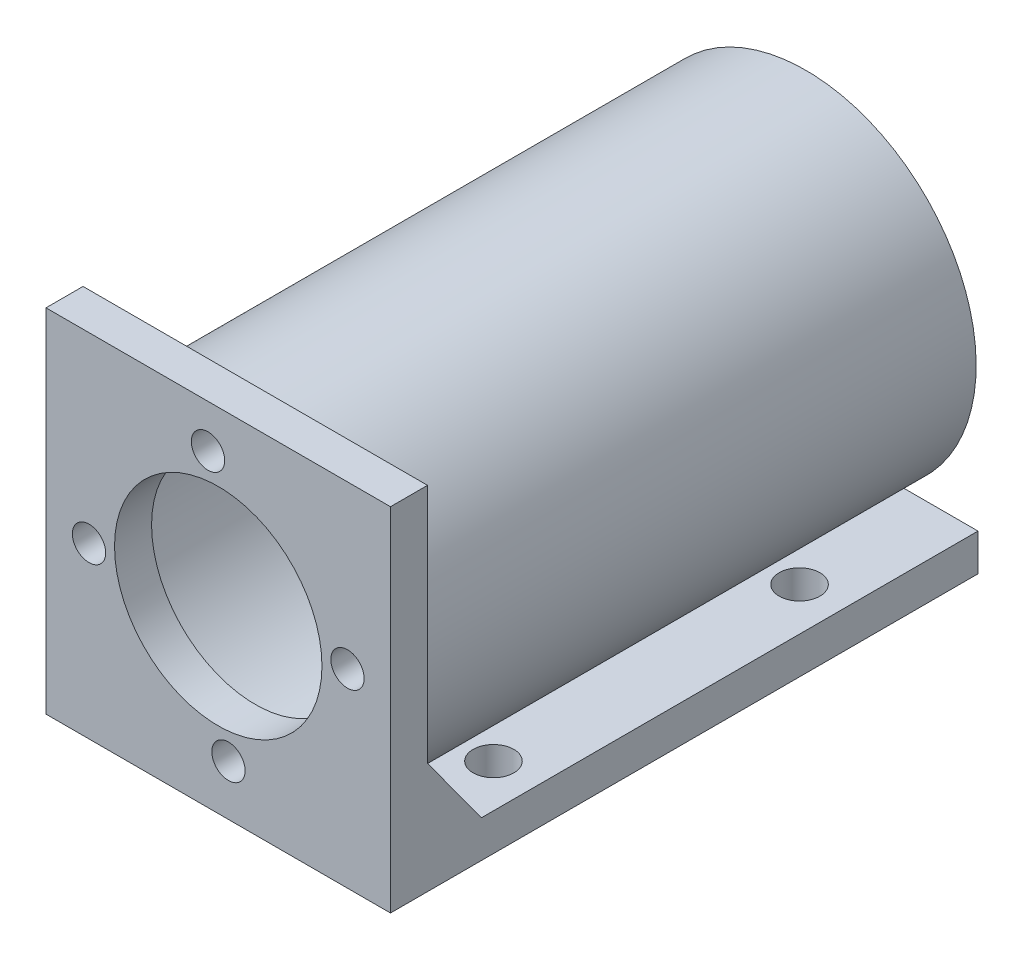
ISO-10303-21;
HEADER;
FILE_DESCRIPTION(('STEP AP214'),'2;1');
FILE_NAME('part.step','',(''),(''),'','','');
FILE_SCHEMA(('AUTOMOTIVE_DESIGN { 1 0 10303 214 1 1 1 1 }'));
ENDSEC;
DATA;
#1=APPLICATION_CONTEXT('core data for automotive mechanical design processes');
#2=APPLICATION_PROTOCOL_DEFINITION('international standard','automotive_design',2000,#1);
#3=PRODUCT_CONTEXT('',#1,'mechanical');
#4=PRODUCT('Part','Part','',(#3));
#5=PRODUCT_RELATED_PRODUCT_CATEGORY('part','',(#4));
#6=PRODUCT_DEFINITION_FORMATION('','',#4);
#7=PRODUCT_DEFINITION_CONTEXT('part definition',#1,'design');
#8=PRODUCT_DEFINITION('design','',#6,#7);
#9=PRODUCT_DEFINITION_SHAPE('','',#8);
#10=(LENGTH_UNIT() NAMED_UNIT(*) SI_UNIT(.MILLI.,.METRE.));
#11=(NAMED_UNIT(*) PLANE_ANGLE_UNIT() SI_UNIT($,.RADIAN.));
#12=(NAMED_UNIT(*) SI_UNIT($,.STERADIAN.) SOLID_ANGLE_UNIT());
#13=UNCERTAINTY_MEASURE_WITH_UNIT(LENGTH_MEASURE(1.E-05),#10,'distance_accuracy_value','');
#14=(GEOMETRIC_REPRESENTATION_CONTEXT(3) GLOBAL_UNCERTAINTY_ASSIGNED_CONTEXT((#13)) GLOBAL_UNIT_ASSIGNED_CONTEXT((#10,
#11,#12)) REPRESENTATION_CONTEXT('',''));
#15=CARTESIAN_POINT('',(0.,0.,0.));
#16=DIRECTION('',(0.,0.,1.));
#17=DIRECTION('',(1.,0.,0.));
#18=AXIS2_PLACEMENT_3D('',#15,#16,#17);
#19=CARTESIAN_POINT('',(0.,0.,0.));
#20=DIRECTION('',(0.,0.,1.));
#21=DIRECTION('',(1.,0.,0.));
#22=AXIS2_PLACEMENT_3D('',#19,#20,#21);
#23=PLANE('',#22);
#24=CARTESIAN_POINT('',(1.3819518431774,-17.4453492112694,0.));
#25=DIRECTION('',(0.,0.,1.));
#26=DIRECTION('',(1.,0.,0.));
#27=AXIS2_PLACEMENT_3D('',#24,#25,#26);
#28=CIRCLE('',#27,2.25000000000108);
#29=CARTESIAN_POINT('',(3.63195184317848,-17.4453492112694,0.));
#30=VERTEX_POINT('',#29);
#31=EDGE_CURVE('E186',#30,#30,#28,.T.);
#32=ORIENTED_EDGE('',*,*,#31,.T.);
#33=EDGE_LOOP('',(#32));
#34=FACE_BOUND('',#33,.T.);
#35=CARTESIAN_POINT('',(0.,0.,0.));
#36=DIRECTION('',(0.,0.,1.));
#37=DIRECTION('',(1.,0.,0.));
#38=AXIS2_PLACEMENT_3D('',#35,#36,#37);
#39=CIRCLE('',#38,14.);
#40=CARTESIAN_POINT('',(14.,0.,0.));
#41=VERTEX_POINT('',#40);
#42=EDGE_CURVE('E150',#41,#41,#39,.T.);
#43=ORIENTED_EDGE('',*,*,#42,.T.);
#44=EDGE_LOOP('',(#43));
#45=FACE_BOUND('',#44,.T.);
#46=CARTESIAN_POINT('',(17.4453492112699,1.38195184317695,0.));
#47=DIRECTION('',(0.,0.,1.));
#48=DIRECTION('',(1.,0.,0.));
#49=AXIS2_PLACEMENT_3D('',#46,#47,#48);
#50=CIRCLE('',#49,2.25000000000043);
#51=CARTESIAN_POINT('',(19.6953492112704,1.38195184317695,0.));
#52=VERTEX_POINT('',#51);
#53=EDGE_CURVE('E175',#52,#52,#50,.T.);
#54=ORIENTED_EDGE('',*,*,#53,.T.);
#55=EDGE_LOOP('',(#54));
#56=FACE_BOUND('',#55,.T.);
#57=CARTESIAN_POINT('',(-1.38195184317642,17.4453492112695,0.));
#58=DIRECTION('',(0.,0.,1.));
#59=DIRECTION('',(1.,0.,0.));
#60=AXIS2_PLACEMENT_3D('',#57,#58,#59);
#61=CIRCLE('',#60,2.25);
#62=CARTESIAN_POINT('',(0.868048156823576,17.4453492112695,0.));
#63=VERTEX_POINT('',#62);
#64=EDGE_CURVE('E172',#63,#63,#61,.T.);
#65=ORIENTED_EDGE('',*,*,#64,.T.);
#66=EDGE_LOOP('',(#65));
#67=FACE_BOUND('',#66,.T.);
#68=CARTESIAN_POINT('',(-17.445349211269,-1.38195184317688,0.));
#69=DIRECTION('',(0.,0.,1.));
#70=DIRECTION('',(1.,0.,0.));
#71=AXIS2_PLACEMENT_3D('',#68,#69,#70);
#72=CIRCLE('',#71,2.25000000000077);
#73=CARTESIAN_POINT('',(-15.1953492112682,-1.38195184317688,0.));
#74=VERTEX_POINT('',#73);
#75=EDGE_CURVE('E145',#74,#74,#72,.T.);
#76=ORIENTED_EDGE('',*,*,#75,.T.);
#77=EDGE_LOOP('',(#76));
#78=FACE_BOUND('',#77,.T.);
#79=CARTESIAN_POINT('',(0.,0.,0.));
#80=DIRECTION('',(0.,0.,1.));
#81=DIRECTION('',(1.,0.,0.));
#82=AXIS2_PLACEMENT_3D('',#79,#80,#81);
#83=CIRCLE('',#82,21.);
#84=CARTESIAN_POINT('',(21.,0.,0.));
#85=VERTEX_POINT('',#84);
#86=EDGE_CURVE('E194',#85,#85,#83,.T.);
#87=ORIENTED_EDGE('',*,*,#86,.F.);
#88=EDGE_LOOP('',(#87));
#89=FACE_BOUND('',#88,.T.);
#90=ADVANCED_FACE('F35',(#34,#45,#56,#67,#78,#89),#23,.F.);
#91=CARTESIAN_POINT('',(23.25,-19.25,-149.));
#92=DIRECTION('',(0.,-1.,0.));
#93=DIRECTION('',(0.,0.,-1.));
#94=AXIS2_PLACEMENT_3D('',#91,#92,#93);
#95=PLANE('',#94);
#96=CARTESIAN_POINT('',(-17.4431355081452,-19.25,-14.7088205213208));
#97=DIRECTION('',(0.,-1.,0.));
#98=DIRECTION('',(0.,0.,1.));
#99=AXIS2_PLACEMENT_3D('',#96,#97,#98);
#100=CIRCLE('',#99,2.75);
#101=CARTESIAN_POINT('',(-17.4431355081452,-19.25,-11.9588205213208));
#102=VERTEX_POINT('',#101);
#103=EDGE_CURVE('E206',#102,#102,#100,.T.);
#104=ORIENTED_EDGE('',*,*,#103,.T.);
#105=EDGE_LOOP('',(#104));
#106=FACE_BOUND('',#105,.T.);
#107=CARTESIAN_POINT('',(-17.4431355081452,-19.25,-56.0212344341267));
#108=DIRECTION('',(0.,-1.,0.));
#109=DIRECTION('',(0.,0.,1.));
#110=AXIS2_PLACEMENT_3D('',#107,#108,#109);
#111=CIRCLE('',#110,2.75);
#112=CARTESIAN_POINT('',(-17.4431355081452,-19.25,-53.2712344341267));
#113=VERTEX_POINT('',#112);
#114=EDGE_CURVE('E210',#113,#113,#111,.T.);
#115=ORIENTED_EDGE('',*,*,#114,.T.);
#116=EDGE_LOOP('',(#115));
#117=FACE_BOUND('',#116,.T.);
#118=DIRECTION('',(0.,0.,-1.));
#119=VECTOR('',#118,1.);
#120=CARTESIAN_POINT('',(-12.5871958751741,-19.25,65.0538238691624));
#121=LINE('',#120,#119);
#122=CARTESIAN_POINT('',(-12.5871958751741,-19.25,-7.26542528005375));
#123=VERTEX_POINT('',#122);
#124=CARTESIAN_POINT('',(-12.5871958751741,-19.25,-74.3053462542633));
#125=VERTEX_POINT('',#124);
#126=EDGE_CURVE('E234',#123,#125,#121,.T.);
#127=ORIENTED_EDGE('',*,*,#126,.T.);
#128=DIRECTION('',(-1.,0.,0.));
#129=VECTOR('',#128,1.);
#130=CARTESIAN_POINT('',(23.25,-19.25,-74.3053462542633));
#131=LINE('',#130,#129);
#132=CARTESIAN_POINT('',(-23.25,-19.25,-74.3053462542633));
#133=VERTEX_POINT('',#132);
#134=EDGE_CURVE('E51',#125,#133,#131,.T.);
#135=ORIENTED_EDGE('',*,*,#134,.T.);
#136=DIRECTION('',(0.,0.,1.));
#137=VECTOR('',#136,1.);
#138=CARTESIAN_POINT('',(-23.25,-19.25,-149.));
#139=LINE('',#138,#137);
#140=CARTESIAN_POINT('',(-23.25,-19.25,-7.26542528005375));
#141=VERTEX_POINT('',#140);
#142=EDGE_CURVE('E138',#133,#141,#139,.T.);
#143=ORIENTED_EDGE('',*,*,#142,.T.);
#144=DIRECTION('',(1.,0.,0.));
#145=VECTOR('',#144,1.);
#146=CARTESIAN_POINT('',(-12.5871958751741,-19.25,-7.26542528005375));
#147=LINE('',#146,#145);
#148=EDGE_CURVE('E224',#141,#123,#147,.T.);
#149=ORIENTED_EDGE('',*,*,#148,.T.);
#150=EDGE_LOOP('',(#127,#135,#143,#149));
#151=FACE_BOUND('',#150,.T.);
#152=ADVANCED_FACE('F278',(#106,#117,#151),#95,.F.);
#153=CARTESIAN_POINT('',(0.,0.,0.));
#154=DIRECTION('',(0.,0.,-1.));
#155=DIRECTION('',(-1.,0.,0.));
#156=AXIS2_PLACEMENT_3D('',#153,#154,#155);
#157=CIRCLE('',#156,23.);
#158=CARTESIAN_POINT('',(-21.0579557412395,-9.24999999999996,0.));
#159=VERTEX_POINT('',#158);
#160=CARTESIAN_POINT('',(21.0579557412395,-9.24999999999996,0.));
#161=VERTEX_POINT('',#160);
#162=EDGE_CURVE('E232',#159,#161,#157,.T.);
#163=ORIENTED_EDGE('',*,*,#162,.F.);
#164=DIRECTION('',(-1.,0.,0.));
#165=VECTOR('',#164,1.);
#166=CARTESIAN_POINT('',(-23.25,-9.24999999999996,0.));
#167=LINE('',#166,#165);
#168=CARTESIAN_POINT('',(-23.25,-9.24999999999996,0.));
#169=VERTEX_POINT('',#168);
#170=EDGE_CURVE('E44',#159,#169,#167,.T.);
#171=ORIENTED_EDGE('',*,*,#170,.T.);
#172=DIRECTION('',(0.,-1.,0.));
#173=VECTOR('',#172,1.);
#174=CARTESIAN_POINT('',(-23.25,0.,0.));
#175=LINE('',#174,#173);
#176=CARTESIAN_POINT('',(-23.25,23.25,0.));
#177=VERTEX_POINT('',#176);
#178=EDGE_CURVE('E184',#177,#169,#175,.T.);
#179=ORIENTED_EDGE('',*,*,#178,.F.);
#180=DIRECTION('',(1.,0.,0.));
#181=VECTOR('',#180,1.);
#182=CARTESIAN_POINT('',(0.,23.25,0.));
#183=LINE('',#182,#181);
#184=CARTESIAN_POINT('',(23.25,23.25,0.));
#185=VERTEX_POINT('',#184);
#186=EDGE_CURVE('E181',#177,#185,#183,.T.);
#187=ORIENTED_EDGE('',*,*,#186,.T.);
#188=DIRECTION('',(0.,-1.,0.));
#189=VECTOR('',#188,1.);
#190=CARTESIAN_POINT('',(23.25,0.,0.));
#191=LINE('',#190,#189);
#192=CARTESIAN_POINT('',(23.25,-9.24999999999996,0.));
#193=VERTEX_POINT('',#192);
#194=EDGE_CURVE('E178',#185,#193,#191,.T.);
#195=ORIENTED_EDGE('',*,*,#194,.T.);
#196=DIRECTION('',(-1.,0.,0.));
#197=VECTOR('',#196,1.);
#198=CARTESIAN_POINT('',(12.5871958751741,-9.24999999999996,0.));
#199=LINE('',#198,#197);
#200=EDGE_CURVE('E216',#193,#161,#199,.T.);
#201=ORIENTED_EDGE('',*,*,#200,.T.);
#202=EDGE_LOOP('',(#163,#171,#179,#187,#195,#201));
#203=FACE_BOUND('',#202,.T.);
#204=ADVANCED_FACE('F237',(#203),#23,.F.);
#205=CARTESIAN_POINT('',(23.25,0.,5.));
#206=DIRECTION('',(1.,0.,0.));
#207=DIRECTION('',(0.,1.,0.));
#208=AXIS2_PLACEMENT_3D('',#205,#206,#207);
#209=PLANE('',#208);
#210=DIRECTION('',(0.,-1.,0.));
#211=VECTOR('',#210,1.);
#212=CARTESIAN_POINT('',(23.25,124.75,-74.3053462542633));
#213=LINE('',#212,#211);
#214=CARTESIAN_POINT('',(23.25,-19.25,-74.3053462542633));
#215=VERTEX_POINT('',#214);
#216=CARTESIAN_POINT('',(23.25,-24.25,-74.3053462542633));
#217=VERTEX_POINT('',#216);
#218=EDGE_CURVE('E112',#215,#217,#213,.T.);
#219=ORIENTED_EDGE('',*,*,#218,.F.);
#220=DIRECTION('',(0.,0.,1.));
#221=VECTOR('',#220,1.);
#222=CARTESIAN_POINT('',(23.25,-19.25,-149.));
#223=LINE('',#222,#221);
#224=CARTESIAN_POINT('',(23.25,-19.25,-7.26542528005375));
#225=VERTEX_POINT('',#224);
#226=EDGE_CURVE('E136',#215,#225,#223,.T.);
#227=ORIENTED_EDGE('',*,*,#226,.T.);
#228=DIRECTION('',(0.,-0.809016994374943,-0.587785252292479));
#229=VECTOR('',#228,1.);
#230=CARTESIAN_POINT('',(23.25,-19.25,-7.26542528005375));
#231=LINE('',#230,#229);
#232=EDGE_CURVE('E222',#225,#193,#231,.F.);
#233=ORIENTED_EDGE('',*,*,#232,.T.);
#234=ORIENTED_EDGE('',*,*,#194,.F.);
#235=DIRECTION('',(0.,0.,-1.));
#236=VECTOR('',#235,1.);
#237=CARTESIAN_POINT('',(23.25,23.25,5.));
#238=LINE('',#237,#236);
#239=CARTESIAN_POINT('',(23.25,23.25,5.));
#240=VERTEX_POINT('',#239);
#241=EDGE_CURVE('E192',#240,#185,#238,.T.);
#242=ORIENTED_EDGE('',*,*,#241,.F.);
#243=DIRECTION('',(0.,-1.,0.));
#244=VECTOR('',#243,1.);
#245=CARTESIAN_POINT('',(23.25,0.,5.));
#246=LINE('',#245,#244);
#247=CARTESIAN_POINT('',(23.25,-24.25,5.));
#248=VERTEX_POINT('',#247);
#249=EDGE_CURVE('E134',#240,#248,#246,.T.);
#250=ORIENTED_EDGE('',*,*,#249,.T.);
#251=DIRECTION('',(0.,0.,1.));
#252=VECTOR('',#251,1.);
#253=CARTESIAN_POINT('',(23.25,-24.25,-149.));
#254=LINE('',#253,#252);
#255=EDGE_CURVE('E128',#217,#248,#254,.T.);
#256=ORIENTED_EDGE('',*,*,#255,.F.);
#257=EDGE_LOOP('',(#219,#227,#233,#234,#242,#250,#256));
#258=FACE_BOUND('',#257,.T.);
#259=ADVANCED_FACE('F132',(#258),#209,.T.);
#260=CARTESIAN_POINT('',(0.,23.25,5.));
#261=DIRECTION('',(0.,1.,0.));
#262=DIRECTION('',(-1.,0.,0.));
#263=AXIS2_PLACEMENT_3D('',#260,#261,#262);
#264=PLANE('',#263);
#265=ORIENTED_EDGE('',*,*,#186,.F.);
#266=DIRECTION('',(0.,0.,-1.));
#267=VECTOR('',#266,1.);
#268=CARTESIAN_POINT('',(-23.25,23.25,5.));
#269=LINE('',#268,#267);
#270=CARTESIAN_POINT('',(-23.25,23.25,5.));
#271=VERTEX_POINT('',#270);
#272=EDGE_CURVE('E169',#271,#177,#269,.T.);
#273=ORIENTED_EDGE('',*,*,#272,.F.);
#274=DIRECTION('',(1.,0.,0.));
#275=VECTOR('',#274,1.);
#276=CARTESIAN_POINT('',(0.,23.25,5.));
#277=LINE('',#276,#275);
#278=EDGE_CURVE('E157',#271,#240,#277,.T.);
#279=ORIENTED_EDGE('',*,*,#278,.T.);
#280=ORIENTED_EDGE('',*,*,#241,.T.);
#281=EDGE_LOOP('',(#265,#273,#279,#280));
#282=FACE_BOUND('',#281,.T.);
#283=ADVANCED_FACE('F249',(#282),#264,.T.);
#284=CARTESIAN_POINT('',(-23.25,0.,5.));
#285=DIRECTION('',(1.,0.,0.));
#286=DIRECTION('',(0.,1.,0.));
#287=AXIS2_PLACEMENT_3D('',#284,#285,#286);
#288=PLANE('',#287);
#289=ORIENTED_EDGE('',*,*,#142,.F.);
#290=DIRECTION('',(0.,-1.,0.));
#291=VECTOR('',#290,1.);
#292=CARTESIAN_POINT('',(-23.25,124.75,-74.3053462542633));
#293=LINE('',#292,#291);
#294=CARTESIAN_POINT('',(-23.25,-24.25,-74.3053462542633));
#295=VERTEX_POINT('',#294);
#296=EDGE_CURVE('E122',#133,#295,#293,.T.);
#297=ORIENTED_EDGE('',*,*,#296,.T.);
#298=DIRECTION('',(0.,0.,1.));
#299=VECTOR('',#298,1.);
#300=CARTESIAN_POINT('',(-23.25,-24.25,-149.));
#301=LINE('',#300,#299);
#302=CARTESIAN_POINT('',(-23.25,-24.25,5.));
#303=VERTEX_POINT('',#302);
#304=EDGE_CURVE('E130',#295,#303,#301,.T.);
#305=ORIENTED_EDGE('',*,*,#304,.T.);
#306=DIRECTION('',(0.,-1.,0.));
#307=VECTOR('',#306,1.);
#308=CARTESIAN_POINT('',(-23.25,0.,5.));
#309=LINE('',#308,#307);
#310=EDGE_CURVE('E160',#271,#303,#309,.T.);
#311=ORIENTED_EDGE('',*,*,#310,.F.);
#312=ORIENTED_EDGE('',*,*,#272,.T.);
#313=ORIENTED_EDGE('',*,*,#178,.T.);
#314=DIRECTION('',(0.,0.809016994374943,0.587785252292479));
#315=VECTOR('',#314,1.);
#316=CARTESIAN_POINT('',(-23.25,-0.818155110278021,6.12609390192775));
#317=LINE('',#316,#315);
#318=EDGE_CURVE('E11',#169,#141,#317,.F.);
#319=ORIENTED_EDGE('',*,*,#318,.T.);
#320=EDGE_LOOP('',(#289,#297,#305,#311,#312,#313,#319));
#321=FACE_BOUND('',#320,.T.);
#322=ADVANCED_FACE('F245',(#321),#288,.F.);
#323=CARTESIAN_POINT('',(1.3819518431774,-17.4453492112694,5.));
#324=DIRECTION('',(0.,0.,-1.));
#325=DIRECTION('',(-1.,0.,0.));
#326=AXIS2_PLACEMENT_3D('',#323,#324,#325);
#327=CYLINDRICAL_SURFACE('',#326,2.25000000000108);
#328=CARTESIAN_POINT('',(1.3819518431774,-17.4453492112694,5.));
#329=DIRECTION('',(0.,0.,1.));
#330=DIRECTION('',(1.,0.,0.));
#331=AXIS2_PLACEMENT_3D('',#328,#329,#330);
#332=CIRCLE('',#331,2.25000000000108);
#333=CARTESIAN_POINT('',(3.63195184317848,-17.4453492112694,5.));
#334=VERTEX_POINT('',#333);
#335=EDGE_CURVE('E163',#334,#334,#332,.T.);
#336=ORIENTED_EDGE('',*,*,#335,.T.);
#337=EDGE_LOOP('',(#336));
#338=FACE_BOUND('',#337,.T.);
#339=ORIENTED_EDGE('',*,*,#31,.F.);
#340=EDGE_LOOP('',(#339));
#341=FACE_BOUND('',#340,.T.);
#342=ADVANCED_FACE('F358',(#338,#341),#327,.F.);
#343=CARTESIAN_POINT('',(17.4453492112699,1.38195184317695,5.));
#344=DIRECTION('',(0.,0.,-1.));
#345=DIRECTION('',(-1.,0.,0.));
#346=AXIS2_PLACEMENT_3D('',#343,#344,#345);
#347=CYLINDRICAL_SURFACE('',#346,2.25000000000043);
#348=CARTESIAN_POINT('',(17.4453492112699,1.38195184317695,5.));
#349=DIRECTION('',(0.,0.,1.));
#350=DIRECTION('',(1.,0.,0.));
#351=AXIS2_PLACEMENT_3D('',#348,#349,#350);
#352=CIRCLE('',#351,2.25000000000043);
#353=CARTESIAN_POINT('',(19.6953492112704,1.38195184317695,5.));
#354=VERTEX_POINT('',#353);
#355=EDGE_CURVE('E153',#354,#354,#352,.T.);
#356=ORIENTED_EDGE('',*,*,#355,.T.);
#357=EDGE_LOOP('',(#356));
#358=FACE_BOUND('',#357,.T.);
#359=ORIENTED_EDGE('',*,*,#53,.F.);
#360=EDGE_LOOP('',(#359));
#361=FACE_BOUND('',#360,.T.);
#362=ADVANCED_FACE('F354',(#358,#361),#347,.F.);
#363=CARTESIAN_POINT('',(-1.38195184317642,17.4453492112695,5.));
#364=DIRECTION('',(0.,0.,-1.));
#365=DIRECTION('',(-1.,0.,0.));
#366=AXIS2_PLACEMENT_3D('',#363,#364,#365);
#367=CYLINDRICAL_SURFACE('',#366,2.25);
#368=CARTESIAN_POINT('',(-1.38195184317642,17.4453492112695,5.));
#369=DIRECTION('',(0.,0.,1.));
#370=DIRECTION('',(1.,0.,0.));
#371=AXIS2_PLACEMENT_3D('',#368,#369,#370);
#372=CIRCLE('',#371,2.25);
#373=CARTESIAN_POINT('',(0.868048156823576,17.4453492112695,5.));
#374=VERTEX_POINT('',#373);
#375=EDGE_CURVE('E149',#374,#374,#372,.T.);
#376=ORIENTED_EDGE('',*,*,#375,.T.);
#377=EDGE_LOOP('',(#376));
#378=FACE_BOUND('',#377,.T.);
#379=ORIENTED_EDGE('',*,*,#64,.F.);
#380=EDGE_LOOP('',(#379));
#381=FACE_BOUND('',#380,.T.);
#382=ADVANCED_FACE('F350',(#378,#381),#367,.F.);
#383=CARTESIAN_POINT('',(-17.445349211269,-1.38195184317688,5.));
#384=DIRECTION('',(0.,0.,-1.));
#385=DIRECTION('',(-1.,0.,0.));
#386=AXIS2_PLACEMENT_3D('',#383,#384,#385);
#387=CYLINDRICAL_SURFACE('',#386,2.25000000000077);
#388=CARTESIAN_POINT('',(-17.445349211269,-1.38195184317688,5.));
#389=DIRECTION('',(0.,0.,1.));
#390=DIRECTION('',(1.,0.,0.));
#391=AXIS2_PLACEMENT_3D('',#388,#389,#390);
#392=CIRCLE('',#391,2.25000000000077);
#393=CARTESIAN_POINT('',(-15.1953492112682,-1.38195184317688,5.));
#394=VERTEX_POINT('',#393);
#395=EDGE_CURVE('E146',#394,#394,#392,.T.);
#396=ORIENTED_EDGE('',*,*,#395,.T.);
#397=EDGE_LOOP('',(#396));
#398=FACE_BOUND('',#397,.T.);
#399=ORIENTED_EDGE('',*,*,#75,.F.);
#400=EDGE_LOOP('',(#399));
#401=FACE_BOUND('',#400,.T.);
#402=ADVANCED_FACE('F347',(#398,#401),#387,.F.);
#403=CARTESIAN_POINT('',(0.,0.,5.));
#404=DIRECTION('',(0.,0.,-1.));
#405=DIRECTION('',(-1.,0.,0.));
#406=AXIS2_PLACEMENT_3D('',#403,#404,#405);
#407=CYLINDRICAL_SURFACE('',#406,14.);
#408=CARTESIAN_POINT('',(0.,0.,5.));
#409=DIRECTION('',(0.,0.,1.));
#410=DIRECTION('',(1.,0.,0.));
#411=AXIS2_PLACEMENT_3D('',#408,#409,#410);
#412=CIRCLE('',#411,14.);
#413=CARTESIAN_POINT('',(14.,0.,5.));
#414=VERTEX_POINT('',#413);
#415=EDGE_CURVE('E166',#414,#414,#412,.T.);
#416=ORIENTED_EDGE('',*,*,#415,.T.);
#417=EDGE_LOOP('',(#416));
#418=FACE_BOUND('',#417,.T.);
#419=ORIENTED_EDGE('',*,*,#42,.F.);
#420=EDGE_LOOP('',(#419));
#421=FACE_BOUND('',#420,.T.);
#422=ADVANCED_FACE('F300',(#418,#421),#407,.F.);
#423=CARTESIAN_POINT('',(0.,0.,5.));
#424=DIRECTION('',(0.,0.,1.));
#425=DIRECTION('',(1.,0.,0.));
#426=AXIS2_PLACEMENT_3D('',#423,#424,#425);
#427=PLANE('',#426);
#428=ORIENTED_EDGE('',*,*,#395,.F.);
#429=EDGE_LOOP('',(#428));
#430=FACE_BOUND('',#429,.T.);
#431=ORIENTED_EDGE('',*,*,#375,.F.);
#432=EDGE_LOOP('',(#431));
#433=FACE_BOUND('',#432,.T.);
#434=ORIENTED_EDGE('',*,*,#355,.F.);
#435=EDGE_LOOP('',(#434));
#436=FACE_BOUND('',#435,.T.);
#437=ORIENTED_EDGE('',*,*,#249,.F.);
#438=ORIENTED_EDGE('',*,*,#278,.F.);
#439=ORIENTED_EDGE('',*,*,#310,.T.);
#440=DIRECTION('',(1.,0.,0.));
#441=VECTOR('',#440,1.);
#442=CARTESIAN_POINT('',(-23.25,-24.25,5.));
#443=LINE('',#442,#441);
#444=EDGE_CURVE('E140',#303,#248,#443,.T.);
#445=ORIENTED_EDGE('',*,*,#444,.T.);
#446=EDGE_LOOP('',(#437,#438,#439,#445));
#447=FACE_BOUND('',#446,.T.);
#448=ORIENTED_EDGE('',*,*,#335,.F.);
#449=EDGE_LOOP('',(#448));
#450=FACE_BOUND('',#449,.T.);
#451=ORIENTED_EDGE('',*,*,#415,.F.);
#452=EDGE_LOOP('',(#451));
#453=FACE_BOUND('',#452,.T.);
#454=ADVANCED_FACE('F271',(#430,#433,#436,#447,#450,#453),#427,.T.);
#455=CARTESIAN_POINT('',(17.4431355081452,-19.25,-56.0212344341267));
#456=DIRECTION('',(0.,1.,0.));
#457=DIRECTION('',(0.,0.,1.));
#458=AXIS2_PLACEMENT_3D('',#455,#456,#457);
#459=CIRCLE('',#458,2.75);
#460=CARTESIAN_POINT('',(17.4431355081452,-19.25,-53.2712344341267));
#461=VERTEX_POINT('',#460);
#462=EDGE_CURVE('E202',#461,#461,#459,.T.);
#463=ORIENTED_EDGE('',*,*,#462,.F.);
#464=EDGE_LOOP('',(#463));
#465=FACE_BOUND('',#464,.T.);
#466=CARTESIAN_POINT('',(17.4431355081452,-19.25,-14.7088205213208));
#467=DIRECTION('',(0.,1.,0.));
#468=DIRECTION('',(0.,0.,1.));
#469=AXIS2_PLACEMENT_3D('',#466,#467,#468);
#470=CIRCLE('',#469,2.75);
#471=CARTESIAN_POINT('',(17.4431355081452,-19.25,-11.9588205213208));
#472=VERTEX_POINT('',#471);
#473=EDGE_CURVE('E198',#472,#472,#470,.T.);
#474=ORIENTED_EDGE('',*,*,#473,.F.);
#475=EDGE_LOOP('',(#474));
#476=FACE_BOUND('',#475,.T.);
#477=ORIENTED_EDGE('',*,*,#226,.F.);
#478=DIRECTION('',(-1.,0.,0.));
#479=VECTOR('',#478,1.);
#480=CARTESIAN_POINT('',(23.25,-19.25,-74.3053462542633));
#481=LINE('',#480,#479);
#482=CARTESIAN_POINT('',(12.5871958751741,-19.25,-74.3053462542633));
#483=VERTEX_POINT('',#482);
#484=EDGE_CURVE('E118',#215,#483,#481,.T.);
#485=ORIENTED_EDGE('',*,*,#484,.T.);
#486=DIRECTION('',(0.,0.,-1.));
#487=VECTOR('',#486,1.);
#488=CARTESIAN_POINT('',(12.5871958751741,-19.25,65.0538238691624));
#489=LINE('',#488,#487);
#490=CARTESIAN_POINT('',(12.5871958751741,-19.25,-7.26542528005375));
#491=VERTEX_POINT('',#490);
#492=EDGE_CURVE('E240',#483,#491,#489,.F.);
#493=ORIENTED_EDGE('',*,*,#492,.T.);
#494=DIRECTION('',(1.,0.,0.));
#495=VECTOR('',#494,1.);
#496=CARTESIAN_POINT('',(23.25,-19.25,-7.26542528005375));
#497=LINE('',#496,#495);
#498=EDGE_CURVE('E213',#491,#225,#497,.T.);
#499=ORIENTED_EDGE('',*,*,#498,.T.);
#500=EDGE_LOOP('',(#477,#485,#493,#499));
#501=FACE_BOUND('',#500,.T.);
#502=ADVANCED_FACE('F282',(#465,#476,#501),#95,.F.);
#503=CARTESIAN_POINT('',(23.25,-24.25,-149.));
#504=DIRECTION('',(0.,1.,0.));
#505=DIRECTION('',(0.,0.,1.));
#506=AXIS2_PLACEMENT_3D('',#503,#504,#505);
#507=PLANE('',#506);
#508=CARTESIAN_POINT('',(-17.4431355081452,-24.25,-56.0212344341267));
#509=DIRECTION('',(0.,1.,0.));
#510=DIRECTION('',(0.,0.,1.));
#511=AXIS2_PLACEMENT_3D('',#508,#509,#510);
#512=CIRCLE('',#511,2.75);
#513=CARTESIAN_POINT('',(-17.4431355081452,-24.25,-53.2712344341267));
#514=VERTEX_POINT('',#513);
#515=EDGE_CURVE('E207',#514,#514,#512,.F.);
#516=ORIENTED_EDGE('',*,*,#515,.F.);
#517=EDGE_LOOP('',(#516));
#518=FACE_BOUND('',#517,.T.);
#519=CARTESIAN_POINT('',(-17.4431355081452,-24.25,-14.7088205213208));
#520=DIRECTION('',(0.,1.,0.));
#521=DIRECTION('',(0.,0.,1.));
#522=AXIS2_PLACEMENT_3D('',#519,#520,#521);
#523=CIRCLE('',#522,2.75);
#524=CARTESIAN_POINT('',(-17.4431355081452,-24.25,-11.9588205213208));
#525=VERTEX_POINT('',#524);
#526=EDGE_CURVE('E203',#525,#525,#523,.F.);
#527=ORIENTED_EDGE('',*,*,#526,.F.);
#528=EDGE_LOOP('',(#527));
#529=FACE_BOUND('',#528,.T.);
#530=CARTESIAN_POINT('',(17.4431355081452,-24.25,-56.0212344341267));
#531=DIRECTION('',(0.,1.,0.));
#532=DIRECTION('',(0.,0.,1.));
#533=AXIS2_PLACEMENT_3D('',#530,#531,#532);
#534=CIRCLE('',#533,2.75);
#535=CARTESIAN_POINT('',(17.4431355081452,-24.25,-53.2712344341267));
#536=VERTEX_POINT('',#535);
#537=EDGE_CURVE('E199',#536,#536,#534,.T.);
#538=ORIENTED_EDGE('',*,*,#537,.T.);
#539=EDGE_LOOP('',(#538));
#540=FACE_BOUND('',#539,.T.);
#541=CARTESIAN_POINT('',(17.4431355081452,-24.25,-14.7088205213208));
#542=DIRECTION('',(0.,1.,0.));
#543=DIRECTION('',(0.,0.,1.));
#544=AXIS2_PLACEMENT_3D('',#541,#542,#543);
#545=CIRCLE('',#544,2.75);
#546=CARTESIAN_POINT('',(17.4431355081452,-24.25,-11.9588205213208));
#547=VERTEX_POINT('',#546);
#548=EDGE_CURVE('E195',#547,#547,#545,.T.);
#549=ORIENTED_EDGE('',*,*,#548,.T.);
#550=EDGE_LOOP('',(#549));
#551=FACE_BOUND('',#550,.T.);
#552=ORIENTED_EDGE('',*,*,#304,.F.);
#553=DIRECTION('',(-1.,0.,0.));
#554=VECTOR('',#553,1.);
#555=CARTESIAN_POINT('',(23.25,-24.25,-74.3053462542633));
#556=LINE('',#555,#554);
#557=EDGE_CURVE('E115',#217,#295,#556,.T.);
#558=ORIENTED_EDGE('',*,*,#557,.F.);
#559=ORIENTED_EDGE('',*,*,#255,.T.);
#560=ORIENTED_EDGE('',*,*,#444,.F.);
#561=EDGE_LOOP('',(#552,#558,#559,#560));
#562=FACE_BOUND('',#561,.T.);
#563=ADVANCED_FACE('F126',(#518,#529,#540,#551,#562),#507,.F.);
#564=CARTESIAN_POINT('',(17.4431355081452,-29.25,-14.7088205213208));
#565=DIRECTION('',(0.,1.,0.));
#566=DIRECTION('',(0.,0.,1.));
#567=AXIS2_PLACEMENT_3D('',#564,#565,#566);
#568=CYLINDRICAL_SURFACE('',#567,2.75);
#569=ORIENTED_EDGE('',*,*,#473,.T.);
#570=EDGE_LOOP('',(#569));
#571=FACE_BOUND('',#570,.T.);
#572=ORIENTED_EDGE('',*,*,#548,.F.);
#573=EDGE_LOOP('',(#572));
#574=FACE_BOUND('',#573,.T.);
#575=ADVANCED_FACE('F298',(#571,#574),#568,.F.);
#576=CARTESIAN_POINT('',(17.4431355081452,-29.25,-56.0212344341267));
#577=DIRECTION('',(0.,1.,0.));
#578=DIRECTION('',(0.,0.,1.));
#579=AXIS2_PLACEMENT_3D('',#576,#577,#578);
#580=CYLINDRICAL_SURFACE('',#579,2.75);
#581=ORIENTED_EDGE('',*,*,#462,.T.);
#582=EDGE_LOOP('',(#581));
#583=FACE_BOUND('',#582,.T.);
#584=ORIENTED_EDGE('',*,*,#537,.F.);
#585=EDGE_LOOP('',(#584));
#586=FACE_BOUND('',#585,.T.);
#587=ADVANCED_FACE('F308',(#583,#586),#580,.F.);
#588=CARTESIAN_POINT('',(-17.4431355081452,-29.25,-14.7088205213208));
#589=DIRECTION('',(0.,1.,0.));
#590=DIRECTION('',(0.,0.,1.));
#591=AXIS2_PLACEMENT_3D('',#588,#589,#590);
#592=CYLINDRICAL_SURFACE('',#591,2.75);
#593=ORIENTED_EDGE('',*,*,#103,.F.);
#594=EDGE_LOOP('',(#593));
#595=FACE_BOUND('',#594,.T.);
#596=ORIENTED_EDGE('',*,*,#526,.T.);
#597=EDGE_LOOP('',(#596));
#598=FACE_BOUND('',#597,.T.);
#599=ADVANCED_FACE('F315',(#595,#598),#592,.F.);
#600=CARTESIAN_POINT('',(-17.4431355081452,-29.25,-56.0212344341267));
#601=DIRECTION('',(0.,1.,0.));
#602=DIRECTION('',(0.,0.,1.));
#603=AXIS2_PLACEMENT_3D('',#600,#601,#602);
#604=CYLINDRICAL_SURFACE('',#603,2.75);
#605=ORIENTED_EDGE('',*,*,#114,.F.);
#606=EDGE_LOOP('',(#605));
#607=FACE_BOUND('',#606,.T.);
#608=ORIENTED_EDGE('',*,*,#515,.T.);
#609=EDGE_LOOP('',(#608));
#610=FACE_BOUND('',#609,.T.);
#611=ADVANCED_FACE('F321',(#607,#610),#604,.F.);
#612=CARTESIAN_POINT('',(0.,0.,0.));
#613=DIRECTION('',(0.,0.,-1.));
#614=DIRECTION('',(-1.,0.,0.));
#615=AXIS2_PLACEMENT_3D('',#612,#613,#614);
#616=CYLINDRICAL_SURFACE('',#615,23.);
#617=CARTESIAN_POINT('',(0.,0.,-74.3053462542633));
#618=DIRECTION('',(0.,0.,1.));
#619=DIRECTION('',(1.,0.,0.));
#620=AXIS2_PLACEMENT_3D('',#617,#618,#619);
#621=CIRCLE('',#620,23.);
#622=EDGE_CURVE('E257',#125,#483,#621,.F.);
#623=ORIENTED_EDGE('',*,*,#622,.F.);
#624=ORIENTED_EDGE('',*,*,#126,.F.);
#625=CARTESIAN_POINT('',(0.,0.,6.72051838404965));
#626=DIRECTION('',(0.,0.587785252292479,-0.809016994374943));
#627=DIRECTION('',(0.,-0.809016994374943,-0.587785252292479));
#628=AXIS2_PLACEMENT_3D('',#625,#626,#627);
#629=ELLIPSE('',#628,28.4295634824953,23.);
#630=EDGE_CURVE('E227',#123,#159,#629,.T.);
#631=ORIENTED_EDGE('',*,*,#630,.T.);
#632=ORIENTED_EDGE('',*,*,#162,.T.);
#633=CARTESIAN_POINT('',(0.,0.,6.72051838404965));
#634=DIRECTION('',(0.,0.587785252292479,-0.809016994374943));
#635=DIRECTION('',(0.,-0.809016994374943,-0.587785252292479));
#636=AXIS2_PLACEMENT_3D('',#633,#634,#635);
#637=ELLIPSE('',#636,28.4295634824953,23.);
#638=EDGE_CURVE('E219',#161,#491,#637,.T.);
#639=ORIENTED_EDGE('',*,*,#638,.T.);
#640=ORIENTED_EDGE('',*,*,#492,.F.);
#641=EDGE_LOOP('',(#623,#624,#631,#632,#639,#640));
#642=FACE_BOUND('',#641,.T.);
#643=ADVANCED_FACE('F231',(#642),#616,.T.);
#644=CARTESIAN_POINT('',(0.,0.,0.));
#645=DIRECTION('',(0.,0.,-1.));
#646=DIRECTION('',(-1.,0.,0.));
#647=AXIS2_PLACEMENT_3D('',#644,#645,#646);
#648=CYLINDRICAL_SURFACE('',#647,21.);
#649=CARTESIAN_POINT('',(0.,0.,-74.3053462542633));
#650=DIRECTION('',(0.,0.,1.));
#651=DIRECTION('',(1.,0.,0.));
#652=AXIS2_PLACEMENT_3D('',#649,#650,#651);
#653=CIRCLE('',#652,21.);
#654=CARTESIAN_POINT('',(21.,0.,-74.3053462542633));
#655=VERTEX_POINT('',#654);
#656=EDGE_CURVE('E39',#655,#655,#653,.F.);
#657=ORIENTED_EDGE('',*,*,#656,.T.);
#658=EDGE_LOOP('',(#657));
#659=FACE_BOUND('',#658,.T.);
#660=ORIENTED_EDGE('',*,*,#86,.T.);
#661=EDGE_LOOP('',(#660));
#662=FACE_BOUND('',#661,.T.);
#663=ADVANCED_FACE('F328',(#659,#662),#648,.F.);
#664=CARTESIAN_POINT('',(23.25,-19.25,-7.26542528005375));
#665=DIRECTION('',(0.,0.587785252292479,-0.809016994374943));
#666=DIRECTION('',(-1.,0.,0.));
#667=AXIS2_PLACEMENT_3D('',#664,#665,#666);
#668=PLANE('',#667);
#669=ORIENTED_EDGE('',*,*,#638,.F.);
#670=ORIENTED_EDGE('',*,*,#200,.F.);
#671=ORIENTED_EDGE('',*,*,#232,.F.);
#672=ORIENTED_EDGE('',*,*,#498,.F.);
#673=EDGE_LOOP('',(#669,#670,#671,#672));
#674=FACE_BOUND('',#673,.T.);
#675=ADVANCED_FACE('F254',(#674),#668,.T.);
#676=CARTESIAN_POINT('',(23.25,-19.25,-7.26542528005375));
#677=DIRECTION('',(0.,0.587785252292479,-0.809016994374943));
#678=DIRECTION('',(-1.,0.,0.));
#679=AXIS2_PLACEMENT_3D('',#676,#677,#678);
#680=PLANE('',#679);
#681=ORIENTED_EDGE('',*,*,#318,.F.);
#682=ORIENTED_EDGE('',*,*,#170,.F.);
#683=ORIENTED_EDGE('',*,*,#630,.F.);
#684=ORIENTED_EDGE('',*,*,#148,.F.);
#685=EDGE_LOOP('',(#681,#682,#683,#684));
#686=FACE_BOUND('',#685,.T.);
#687=ADVANCED_FACE('F37',(#686),#680,.T.);
#688=CARTESIAN_POINT('',(23.25,124.75,-74.3053462542633));
#689=DIRECTION('',(0.,0.,1.));
#690=DIRECTION('',(1.,0.,0.));
#691=AXIS2_PLACEMENT_3D('',#688,#689,#690);
#692=PLANE('',#691);
#693=ORIENTED_EDGE('',*,*,#656,.F.);
#694=EDGE_LOOP('',(#693));
#695=FACE_BOUND('',#694,.T.);
#696=ORIENTED_EDGE('',*,*,#622,.T.);
#697=ORIENTED_EDGE('',*,*,#484,.F.);
#698=ORIENTED_EDGE('',*,*,#218,.T.);
#699=ORIENTED_EDGE('',*,*,#557,.T.);
#700=ORIENTED_EDGE('',*,*,#296,.F.);
#701=ORIENTED_EDGE('',*,*,#134,.F.);
#702=EDGE_LOOP('',(#696,#697,#698,#699,#700,#701));
#703=FACE_BOUND('',#702,.T.);
#704=ADVANCED_FACE('F114',(#695,#703),#692,.F.);
#705=CLOSED_SHELL('',(#90,#152,#204,#259,#283,#322,#342,#362,#382,#402,#422,#454,#502,#563,#575,
#587,#599,#611,#643,#663,#675,#687,#704));
#706=MANIFOLD_SOLID_BREP('B2',#705);
#707=ADVANCED_BREP_SHAPE_REPRESENTATION('',(#18,#706),#14);
#708=SHAPE_DEFINITION_REPRESENTATION(#9,#707);
ENDSEC;
END-ISO-10303-21;
